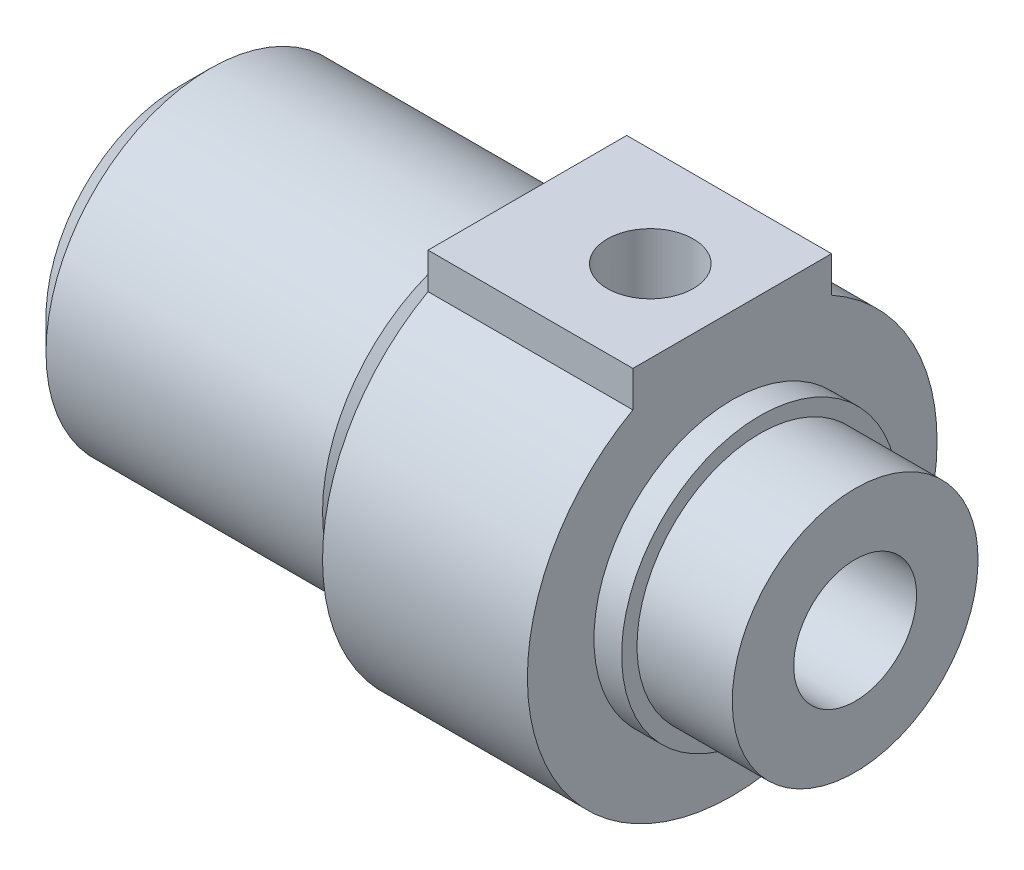
ISO-10303-21;
HEADER;
FILE_DESCRIPTION(('STEP AP214'),'2;1');
FILE_NAME('part.step','',(''),(''),'','','');
FILE_SCHEMA(('AUTOMOTIVE_DESIGN { 1 0 10303 214 1 1 1 1 }'));
ENDSEC;
DATA;
#1=APPLICATION_CONTEXT('core data for automotive mechanical design processes');
#2=APPLICATION_PROTOCOL_DEFINITION('international standard','automotive_design',2000,#1);
#3=PRODUCT_CONTEXT('',#1,'mechanical');
#4=PRODUCT('Part','Part','',(#3));
#5=PRODUCT_RELATED_PRODUCT_CATEGORY('part','',(#4));
#6=PRODUCT_DEFINITION_FORMATION('','',#4);
#7=PRODUCT_DEFINITION_CONTEXT('part definition',#1,'design');
#8=PRODUCT_DEFINITION('design','',#6,#7);
#9=PRODUCT_DEFINITION_SHAPE('','',#8);
#10=(LENGTH_UNIT() NAMED_UNIT(*) SI_UNIT(.MILLI.,.METRE.));
#11=(NAMED_UNIT(*) PLANE_ANGLE_UNIT() SI_UNIT($,.RADIAN.));
#12=(NAMED_UNIT(*) SI_UNIT($,.STERADIAN.) SOLID_ANGLE_UNIT());
#13=UNCERTAINTY_MEASURE_WITH_UNIT(LENGTH_MEASURE(1.E-05),#10,'distance_accuracy_value','');
#14=(GEOMETRIC_REPRESENTATION_CONTEXT(3) GLOBAL_UNCERTAINTY_ASSIGNED_CONTEXT((#13)) GLOBAL_UNIT_ASSIGNED_CONTEXT((#10,
#11,#12)) REPRESENTATION_CONTEXT('',''));
#15=CARTESIAN_POINT('',(0.,0.,0.));
#16=DIRECTION('',(0.,0.,1.));
#17=DIRECTION('',(1.,0.,0.));
#18=AXIS2_PLACEMENT_3D('',#15,#16,#17);
#19=CARTESIAN_POINT('',(33.,10.5,4.85));
#20=DIRECTION('',(0.,-1.,0.));
#21=DIRECTION('',(0.,0.,-1.));
#22=AXIS2_PLACEMENT_3D('',#19,#20,#21);
#23=PLANE('',#22);
#24=CARTESIAN_POINT('',(23.,10.5,0.));
#25=DIRECTION('',(0.,1.,0.));
#26=DIRECTION('',(0.,0.,1.));
#27=AXIS2_PLACEMENT_3D('',#24,#25,#26);
#28=CIRCLE('',#27,2.1);
#29=CARTESIAN_POINT('',(23.,10.5,2.1));
#30=VERTEX_POINT('',#29);
#31=EDGE_CURVE('E195',#30,#30,#28,.T.);
#32=ORIENTED_EDGE('',*,*,#31,.F.);
#33=EDGE_LOOP('',(#32));
#34=FACE_BOUND('',#33,.T.);
#35=DIRECTION('',(0.,0.,-1.));
#36=VECTOR('',#35,1.);
#37=CARTESIAN_POINT('',(17.,10.5,4.85));
#38=LINE('',#37,#36);
#39=CARTESIAN_POINT('',(17.,10.5,4.85));
#40=VERTEX_POINT('',#39);
#41=CARTESIAN_POINT('',(17.,10.5,-4.85));
#42=VERTEX_POINT('',#41);
#43=EDGE_CURVE('E57',#40,#42,#38,.T.);
#44=ORIENTED_EDGE('',*,*,#43,.F.);
#45=DIRECTION('',(-1.,0.,0.));
#46=VECTOR('',#45,1.);
#47=CARTESIAN_POINT('',(33.,10.5,4.85));
#48=LINE('',#47,#46);
#49=CARTESIAN_POINT('',(27.,10.5,4.85));
#50=VERTEX_POINT('',#49);
#51=EDGE_CURVE('E104',#50,#40,#48,.T.);
#52=ORIENTED_EDGE('',*,*,#51,.F.);
#53=DIRECTION('',(0.,0.,-1.));
#54=VECTOR('',#53,1.);
#55=CARTESIAN_POINT('',(27.,10.5,4.85));
#56=LINE('',#55,#54);
#57=CARTESIAN_POINT('',(27.,10.5,-4.85));
#58=VERTEX_POINT('',#57);
#59=EDGE_CURVE('E106',#50,#58,#56,.T.);
#60=ORIENTED_EDGE('',*,*,#59,.T.);
#61=DIRECTION('',(-1.,0.,0.));
#62=VECTOR('',#61,1.);
#63=CARTESIAN_POINT('',(33.,10.5,-4.85));
#64=LINE('',#63,#62);
#65=EDGE_CURVE('E102',#58,#42,#64,.T.);
#66=ORIENTED_EDGE('',*,*,#65,.T.);
#67=EDGE_LOOP('',(#44,#52,#60,#66));
#68=FACE_BOUND('',#67,.T.);
#69=ADVANCED_FACE('F36',(#34,#68),#23,.F.);
#70=CARTESIAN_POINT('',(33.,8.74514150828905,4.85));
#71=DIRECTION('',(0.,0.,-1.));
#72=DIRECTION('',(-1.,0.,0.));
#73=AXIS2_PLACEMENT_3D('',#70,#71,#72);
#74=PLANE('',#73);
#75=DIRECTION('',(0.,1.,0.));
#76=VECTOR('',#75,1.);
#77=CARTESIAN_POINT('',(17.,8.74514150828905,4.85));
#78=LINE('',#77,#76);
#79=CARTESIAN_POINT('',(17.,8.74514150828905,4.85));
#80=VERTEX_POINT('',#79);
#81=EDGE_CURVE('E98',#80,#40,#78,.T.);
#82=ORIENTED_EDGE('',*,*,#81,.F.);
#83=DIRECTION('',(-1.,0.,0.));
#84=VECTOR('',#83,1.);
#85=CARTESIAN_POINT('',(33.,8.74514150828905,4.85));
#86=LINE('',#85,#84);
#87=CARTESIAN_POINT('',(27.,8.74514150828905,4.85));
#88=VERTEX_POINT('',#87);
#89=EDGE_CURVE('E97',#88,#80,#86,.T.);
#90=ORIENTED_EDGE('',*,*,#89,.F.);
#91=DIRECTION('',(0.,1.,0.));
#92=VECTOR('',#91,1.);
#93=CARTESIAN_POINT('',(27.,8.74514150828905,4.85));
#94=LINE('',#93,#92);
#95=EDGE_CURVE('E224',#88,#50,#94,.T.);
#96=ORIENTED_EDGE('',*,*,#95,.T.);
#97=ORIENTED_EDGE('',*,*,#51,.T.);
#98=EDGE_LOOP('',(#82,#90,#96,#97));
#99=FACE_BOUND('',#98,.T.);
#100=ADVANCED_FACE('F132',(#99),#74,.F.);
#101=CARTESIAN_POINT('',(33.,0.,0.));
#102=DIRECTION('',(-1.,0.,0.));
#103=DIRECTION('',(0.,0.,1.));
#104=AXIS2_PLACEMENT_3D('',#101,#102,#103);
#105=CYLINDRICAL_SURFACE('',#104,10.);
#106=CARTESIAN_POINT('',(17.,0.,0.));
#107=DIRECTION('',(-1.,0.,0.));
#108=DIRECTION('',(0.,0.,1.));
#109=AXIS2_PLACEMENT_3D('',#106,#107,#108);
#110=CIRCLE('',#109,10.);
#111=CARTESIAN_POINT('',(17.,8.74514150828905,-4.85));
#112=VERTEX_POINT('',#111);
#113=EDGE_CURVE('E83',#112,#80,#110,.T.);
#114=ORIENTED_EDGE('',*,*,#113,.F.);
#115=DIRECTION('',(-1.,0.,0.));
#116=VECTOR('',#115,1.);
#117=CARTESIAN_POINT('',(33.,8.74514150828905,-4.85));
#118=LINE('',#117,#116);
#119=CARTESIAN_POINT('',(27.,8.74514150828905,-4.85));
#120=VERTEX_POINT('',#119);
#121=EDGE_CURVE('E95',#120,#112,#118,.T.);
#122=ORIENTED_EDGE('',*,*,#121,.F.);
#123=CARTESIAN_POINT('',(27.,0.,0.));
#124=DIRECTION('',(-1.,0.,0.));
#125=DIRECTION('',(0.,-1.,0.));
#126=AXIS2_PLACEMENT_3D('',#123,#124,#125);
#127=CIRCLE('',#126,10.);
#128=EDGE_CURVE('E65',#120,#88,#127,.T.);
#129=ORIENTED_EDGE('',*,*,#128,.T.);
#130=ORIENTED_EDGE('',*,*,#89,.T.);
#131=EDGE_LOOP('',(#114,#122,#129,#130));
#132=FACE_BOUND('',#131,.T.);
#133=ADVANCED_FACE('F94',(#132),#105,.T.);
#134=CARTESIAN_POINT('',(33.,8.74514150828905,-4.85));
#135=DIRECTION('',(0.,0.,1.));
#136=DIRECTION('',(1.,0.,0.));
#137=AXIS2_PLACEMENT_3D('',#134,#135,#136);
#138=PLANE('',#137);
#139=DIRECTION('',(0.,-1.,0.));
#140=VECTOR('',#139,1.);
#141=CARTESIAN_POINT('',(17.,8.74514150828905,-4.85));
#142=LINE('',#141,#140);
#143=EDGE_CURVE('E80',#42,#112,#142,.T.);
#144=ORIENTED_EDGE('',*,*,#143,.F.);
#145=ORIENTED_EDGE('',*,*,#65,.F.);
#146=DIRECTION('',(0.,-1.,0.));
#147=VECTOR('',#146,1.);
#148=CARTESIAN_POINT('',(27.,8.74514150828905,-4.85));
#149=LINE('',#148,#147);
#150=EDGE_CURVE('E89',#58,#120,#149,.T.);
#151=ORIENTED_EDGE('',*,*,#150,.T.);
#152=ORIENTED_EDGE('',*,*,#121,.T.);
#153=EDGE_LOOP('',(#144,#145,#151,#152));
#154=FACE_BOUND('',#153,.T.);
#155=ADVANCED_FACE('F101',(#154),#138,.F.);
#156=CARTESIAN_POINT('',(27.,14.,0.));
#157=DIRECTION('',(-1.,0.,0.));
#158=DIRECTION('',(0.,-1.,0.));
#159=AXIS2_PLACEMENT_3D('',#156,#157,#158);
#160=PLANE('',#159);
#161=CARTESIAN_POINT('',(27.,0.,0.));
#162=DIRECTION('',(1.,0.,0.));
#163=DIRECTION('',(0.,1.,0.));
#164=AXIS2_PLACEMENT_3D('',#161,#162,#163);
#165=CIRCLE('',#164,6.75);
#166=CARTESIAN_POINT('',(27.,6.75,0.));
#167=VERTEX_POINT('',#166);
#168=EDGE_CURVE('E220',#167,#167,#165,.T.);
#169=ORIENTED_EDGE('',*,*,#168,.F.);
#170=EDGE_LOOP('',(#169));
#171=FACE_BOUND('',#170,.T.);
#172=ORIENTED_EDGE('',*,*,#95,.F.);
#173=ORIENTED_EDGE('',*,*,#128,.F.);
#174=ORIENTED_EDGE('',*,*,#150,.F.);
#175=ORIENTED_EDGE('',*,*,#59,.F.);
#176=EDGE_LOOP('',(#172,#173,#174,#175));
#177=FACE_BOUND('',#176,.T.);
#178=ADVANCED_FACE('F145',(#171,#177),#160,.F.);
#179=CARTESIAN_POINT('',(45.5,0.,0.));
#180=DIRECTION('',(1.,0.,0.));
#181=DIRECTION('',(0.,1.,0.));
#182=AXIS2_PLACEMENT_3D('',#179,#180,#181);
#183=CYLINDRICAL_SURFACE('',#182,6.75);
#184=CARTESIAN_POINT('',(28.35,0.,0.));
#185=DIRECTION('',(1.,0.,0.));
#186=DIRECTION('',(0.,1.,0.));
#187=AXIS2_PLACEMENT_3D('',#184,#185,#186);
#188=CIRCLE('',#187,6.75);
#189=CARTESIAN_POINT('',(28.35,6.75,0.));
#190=VERTEX_POINT('',#189);
#191=EDGE_CURVE('E217',#190,#190,#188,.T.);
#192=ORIENTED_EDGE('',*,*,#191,.F.);
#193=EDGE_LOOP('',(#192));
#194=FACE_BOUND('',#193,.T.);
#195=ORIENTED_EDGE('',*,*,#168,.T.);
#196=EDGE_LOOP('',(#195));
#197=FACE_BOUND('',#196,.T.);
#198=ADVANCED_FACE('F154',(#194,#197),#183,.T.);
#199=CARTESIAN_POINT('',(28.35,6.75,0.));
#200=DIRECTION('',(-1.,0.,0.));
#201=DIRECTION('',(0.,-1.,0.));
#202=AXIS2_PLACEMENT_3D('',#199,#200,#201);
#203=PLANE('',#202);
#204=CARTESIAN_POINT('',(28.35,0.,0.));
#205=DIRECTION('',(1.,0.,0.));
#206=DIRECTION('',(0.,1.,0.));
#207=AXIS2_PLACEMENT_3D('',#204,#205,#206);
#208=CIRCLE('',#207,6.);
#209=CARTESIAN_POINT('',(28.35,6.,0.));
#210=VERTEX_POINT('',#209);
#211=EDGE_CURVE('E214',#210,#210,#208,.T.);
#212=ORIENTED_EDGE('',*,*,#211,.F.);
#213=EDGE_LOOP('',(#212));
#214=FACE_BOUND('',#213,.T.);
#215=ORIENTED_EDGE('',*,*,#191,.T.);
#216=EDGE_LOOP('',(#215));
#217=FACE_BOUND('',#216,.T.);
#218=ADVANCED_FACE('F158',(#214,#217),#203,.F.);
#219=CARTESIAN_POINT('',(45.5,0.,0.));
#220=DIRECTION('',(1.,0.,0.));
#221=DIRECTION('',(0.,1.,0.));
#222=AXIS2_PLACEMENT_3D('',#219,#220,#221);
#223=CYLINDRICAL_SURFACE('',#222,6.);
#224=CARTESIAN_POINT('',(33.,0.,0.));
#225=DIRECTION('',(1.,0.,0.));
#226=DIRECTION('',(0.,1.,0.));
#227=AXIS2_PLACEMENT_3D('',#224,#225,#226);
#228=CIRCLE('',#227,6.);
#229=CARTESIAN_POINT('',(33.,6.,0.));
#230=VERTEX_POINT('',#229);
#231=EDGE_CURVE('E211',#230,#230,#228,.T.);
#232=ORIENTED_EDGE('',*,*,#231,.F.);
#233=EDGE_LOOP('',(#232));
#234=FACE_BOUND('',#233,.T.);
#235=ORIENTED_EDGE('',*,*,#211,.T.);
#236=EDGE_LOOP('',(#235));
#237=FACE_BOUND('',#236,.T.);
#238=ADVANCED_FACE('F150',(#234,#237),#223,.T.);
#239=CARTESIAN_POINT('',(33.,0.,0.));
#240=DIRECTION('',(1.,0.,0.));
#241=DIRECTION('',(0.,0.,-1.));
#242=AXIS2_PLACEMENT_3D('',#239,#240,#241);
#243=PLANE('',#242);
#244=CARTESIAN_POINT('',(33.,0.,0.));
#245=DIRECTION('',(1.,0.,0.));
#246=DIRECTION('',(0.,0.,-1.));
#247=AXIS2_PLACEMENT_3D('',#244,#245,#246);
#248=CIRCLE('',#247,3.);
#249=CARTESIAN_POINT('',(33.,0.,-3.));
#250=VERTEX_POINT('',#249);
#251=EDGE_CURVE('E188',#250,#250,#248,.T.);
#252=ORIENTED_EDGE('',*,*,#251,.F.);
#253=EDGE_LOOP('',(#252));
#254=FACE_BOUND('',#253,.T.);
#255=ORIENTED_EDGE('',*,*,#231,.T.);
#256=EDGE_LOOP('',(#255));
#257=FACE_BOUND('',#256,.T.);
#258=ADVANCED_FACE('F147',(#254,#257),#243,.T.);
#259=CARTESIAN_POINT('',(17.,7.5,0.));
#260=DIRECTION('',(-1.,0.,0.));
#261=DIRECTION('',(0.,0.,1.));
#262=AXIS2_PLACEMENT_3D('',#259,#260,#261);
#263=PLANE('',#262);
#264=CARTESIAN_POINT('',(17.,0.,0.));
#265=DIRECTION('',(-1.,0.,0.));
#266=DIRECTION('',(0.,0.,1.));
#267=AXIS2_PLACEMENT_3D('',#264,#265,#266);
#268=CIRCLE('',#267,7.5);
#269=CARTESIAN_POINT('',(17.,0.,7.5));
#270=VERTEX_POINT('',#269);
#271=EDGE_CURVE('E99',#270,#270,#268,.T.);
#272=ORIENTED_EDGE('',*,*,#271,.F.);
#273=EDGE_LOOP('',(#272));
#274=FACE_BOUND('',#273,.T.);
#275=ORIENTED_EDGE('',*,*,#43,.T.);
#276=ORIENTED_EDGE('',*,*,#143,.T.);
#277=ORIENTED_EDGE('',*,*,#113,.T.);
#278=ORIENTED_EDGE('',*,*,#81,.T.);
#279=EDGE_LOOP('',(#275,#276,#277,#278));
#280=FACE_BOUND('',#279,.T.);
#281=ADVANCED_FACE('F82',(#274,#280),#263,.T.);
#282=CARTESIAN_POINT('',(0.,0.,0.));
#283=DIRECTION('',(-1.,0.,0.));
#284=DIRECTION('',(0.,0.,1.));
#285=AXIS2_PLACEMENT_3D('',#282,#283,#284);
#286=CYLINDRICAL_SURFACE('',#285,7.5);
#287=ORIENTED_EDGE('',*,*,#271,.T.);
#288=EDGE_LOOP('',(#287));
#289=FACE_BOUND('',#288,.T.);
#290=CARTESIAN_POINT('',(15.5,0.,0.));
#291=DIRECTION('',(-1.,0.,0.));
#292=DIRECTION('',(0.,0.,1.));
#293=AXIS2_PLACEMENT_3D('',#290,#291,#292);
#294=CIRCLE('',#293,7.5);
#295=CARTESIAN_POINT('',(15.5,0.,7.5));
#296=VERTEX_POINT('',#295);
#297=EDGE_CURVE('E204',#296,#296,#294,.T.);
#298=ORIENTED_EDGE('',*,*,#297,.F.);
#299=EDGE_LOOP('',(#298));
#300=FACE_BOUND('',#299,.T.);
#301=ADVANCED_FACE('F168',(#289,#300),#286,.T.);
#302=CARTESIAN_POINT('',(15.,0.,0.));
#303=DIRECTION('',(-1.,0.,0.));
#304=DIRECTION('',(0.,0.,1.));
#305=AXIS2_PLACEMENT_3D('',#302,#303,#304);
#306=CONICAL_SURFACE('',#305,8.,0.78539816339745);
#307=ORIENTED_EDGE('',*,*,#297,.T.);
#308=EDGE_LOOP('',(#307));
#309=FACE_BOUND('',#308,.T.);
#310=CARTESIAN_POINT('',(15.,0.,0.));
#311=DIRECTION('',(-1.,0.,0.));
#312=DIRECTION('',(0.,0.,1.));
#313=AXIS2_PLACEMENT_3D('',#310,#311,#312);
#314=CIRCLE('',#313,8.);
#315=CARTESIAN_POINT('',(15.,0.,8.));
#316=VERTEX_POINT('',#315);
#317=EDGE_CURVE('E197',#316,#316,#314,.T.);
#318=ORIENTED_EDGE('',*,*,#317,.F.);
#319=EDGE_LOOP('',(#318));
#320=FACE_BOUND('',#319,.T.);
#321=ADVANCED_FACE('F172',(#309,#320),#306,.T.);
#322=CARTESIAN_POINT('',(0.,0.,0.));
#323=DIRECTION('',(-1.,0.,0.));
#324=DIRECTION('',(0.,0.,1.));
#325=AXIS2_PLACEMENT_3D('',#322,#323,#324);
#326=CYLINDRICAL_SURFACE('',#325,8.);
#327=CARTESIAN_POINT('',(1.50000000000001,0.,0.));
#328=DIRECTION('',(1.,0.,0.));
#329=DIRECTION('',(0.,0.,-1.));
#330=AXIS2_PLACEMENT_3D('',#327,#328,#329);
#331=CIRCLE('',#330,8.);
#332=CARTESIAN_POINT('',(1.50000000000001,0.,-8.));
#333=VERTEX_POINT('',#332);
#334=EDGE_CURVE('E11',#333,#333,#331,.T.);
#335=ORIENTED_EDGE('',*,*,#334,.T.);
#336=EDGE_LOOP('',(#335));
#337=FACE_BOUND('',#336,.T.);
#338=ORIENTED_EDGE('',*,*,#317,.T.);
#339=EDGE_LOOP('',(#338));
#340=FACE_BOUND('',#339,.T.);
#341=ADVANCED_FACE('F127',(#337,#340),#326,.T.);
#342=CARTESIAN_POINT('',(0.,0.,0.));
#343=DIRECTION('',(1.,0.,0.));
#344=DIRECTION('',(0.,0.,-1.));
#345=AXIS2_PLACEMENT_3D('',#342,#343,#344);
#346=PLANE('',#345);
#347=CARTESIAN_POINT('',(0.,0.,0.));
#348=DIRECTION('',(1.,0.,0.));
#349=DIRECTION('',(0.,0.,-1.));
#350=AXIS2_PLACEMENT_3D('',#347,#348,#349);
#351=CIRCLE('',#350,3.);
#352=CARTESIAN_POINT('',(0.,0.,-3.));
#353=VERTEX_POINT('',#352);
#354=EDGE_CURVE('E192',#353,#353,#351,.T.);
#355=ORIENTED_EDGE('',*,*,#354,.T.);
#356=EDGE_LOOP('',(#355));
#357=FACE_BOUND('',#356,.T.);
#358=CARTESIAN_POINT('',(0.,0.,0.));
#359=DIRECTION('',(1.,0.,0.));
#360=DIRECTION('',(0.,0.,-1.));
#361=AXIS2_PLACEMENT_3D('',#358,#359,#360);
#362=CIRCLE('',#361,6.49999999999999);
#363=CARTESIAN_POINT('',(0.,0.,-6.49999999999999));
#364=VERTEX_POINT('',#363);
#365=EDGE_CURVE('E50',#364,#364,#362,.F.);
#366=ORIENTED_EDGE('',*,*,#365,.T.);
#367=EDGE_LOOP('',(#366));
#368=FACE_BOUND('',#367,.T.);
#369=ADVANCED_FACE('F116',(#357,#368),#346,.F.);
#370=CARTESIAN_POINT('',(0.,0.,0.));
#371=DIRECTION('',(1.,0.,0.));
#372=DIRECTION('',(0.,0.,-1.));
#373=AXIS2_PLACEMENT_3D('',#370,#371,#372);
#374=CONICAL_SURFACE('',#373,6.49999999999999,0.785398163397448);
#375=ORIENTED_EDGE('',*,*,#334,.F.);
#376=EDGE_LOOP('',(#375));
#377=FACE_BOUND('',#376,.T.);
#378=ORIENTED_EDGE('',*,*,#365,.F.);
#379=EDGE_LOOP('',(#378));
#380=FACE_BOUND('',#379,.T.);
#381=ADVANCED_FACE('F38',(#377,#380),#374,.T.);
#382=CARTESIAN_POINT('',(23.,10.5,0.));
#383=DIRECTION('',(0.,1.,0.));
#384=DIRECTION('',(0.,0.,1.));
#385=AXIS2_PLACEMENT_3D('',#382,#383,#384);
#386=CYLINDRICAL_SURFACE('',#385,2.1);
#387=CARTESIAN_POINT('',(23.,2.14242852856286,2.1));
#388=CARTESIAN_POINT('',(22.8991988179027,2.14243638279411,2.09999602164293));
#389=CARTESIAN_POINT('',(22.7983754728224,2.14968361222002,2.09267425451303));
#390=CARTESIAN_POINT('',(22.6004673952412,2.17713849427744,2.06408052690835));
#391=CARTESIAN_POINT('',(22.5033914844298,2.19737496074822,2.04277754974696));
#392=CARTESIAN_POINT('',(22.3165820766888,2.24699925671913,1.98804598401033));
#393=CARTESIAN_POINT('',(22.2267794921517,2.27628384865,1.95475351750639));
#394=CARTESIAN_POINT('',(22.0542401894225,2.34052168482311,1.87736165117184));
#395=CARTESIAN_POINT('',(21.971503963861,2.37547532379077,1.83326149871241));
#396=CARTESIAN_POINT('',(21.7995826235148,2.45442122730989,1.72654345994895));
#397=CARTESIAN_POINT('',(21.71180552072,2.49892440249037,1.66203515877101));
#398=CARTESIAN_POINT('',(21.5470635982075,2.587704985701,1.52013414958954));
#399=CARTESIAN_POINT('',(21.4701123074175,2.63198204575611,1.4427255794177));
#400=CARTESIAN_POINT('',(21.316441193349,2.72396309113983,1.26173250355452));
#401=CARTESIAN_POINT('',(21.2418942211988,2.7710097406898,1.15593562828217));
#402=CARTESIAN_POINT('',(21.1123767833799,2.85494261250272,0.929408573839368));
#403=CARTESIAN_POINT('',(21.0573671660404,2.89184912098326,0.80870892096122));
#404=CARTESIAN_POINT('',(20.9822063496233,2.94295124645066,0.589969945445681));
#405=CARTESIAN_POINT('',(20.9566581203425,2.96058586289675,0.494574305038635));
#406=CARTESIAN_POINT('',(20.9191737707145,2.98657838567664,0.299930223787058));
#407=CARTESIAN_POINT('',(20.9072267817453,2.99494369887954,0.200684924844656));
#408=CARTESIAN_POINT('',(20.8976169057927,3.00166671758024,0.000967143719220179));
#409=CARTESIAN_POINT('',(20.8999817606914,3.00000498681155,-0.0995073448428438));
#410=CARTESIAN_POINT('',(20.9189143274313,2.98678296023488,-0.298450041145121));
#411=CARTESIAN_POINT('',(20.9354859998781,2.97521990411617,-0.3969176815744));
#412=CARTESIAN_POINT('',(20.98136721481,2.9435711394848,-0.586910014758707));
#413=CARTESIAN_POINT('',(21.0103774656245,2.92368592848238,-0.678541865368288));
#414=CARTESIAN_POINT('',(21.0797757807128,2.876909009763,-0.855439349247825));
#415=CARTESIAN_POINT('',(21.1201660801607,2.85001592569624,-0.940703727706019));
#416=CARTESIAN_POINT('',(21.2160821260957,2.78763084510121,-1.11283793862578));
#417=CARTESIAN_POINT('',(21.2727978384847,2.75151250378176,-1.19881384252342));
#418=CARTESIAN_POINT('',(21.3970977260072,2.67523565239691,-1.3605619568758));
#419=CARTESIAN_POINT('',(21.4646936065031,2.63507280869808,-1.43632301459623));
#420=CARTESIAN_POINT('',(21.6225579565979,2.54604490567428,-1.58960261822576));
#421=CARTESIAN_POINT('',(21.7147195940943,2.4969066890714,-1.6650186720166));
#422=CARTESIAN_POINT('',(21.9115094955512,2.40154085459289,-1.79983510095356));
#423=CARTESIAN_POINT('',(22.0161345280853,2.3553124870012,-1.85923961448999));
#424=CARTESIAN_POINT('',(22.2114331109597,2.28159802338742,-1.94855264825869));
#425=CARTESIAN_POINT('',(22.2997254854026,2.25225087153781,-1.98210609109212));
#426=CARTESIAN_POINT('',(22.4822563241486,2.20236114038834,-2.03740031989552));
#427=CARTESIAN_POINT('',(22.5764832964627,2.18180211044458,-2.05916319745108));
#428=CARTESIAN_POINT('',(22.7699480304865,2.15261274855801,-2.08967380066584));
#429=CARTESIAN_POINT('',(22.8692268766363,2.14410534183546,-2.09828747378879));
#430=CARTESIAN_POINT('',(23.0681948287142,2.1412086525496,-2.10124630568856));
#431=CARTESIAN_POINT('',(23.1678837718425,2.14681422301691,-2.09559666625962));
#432=CARTESIAN_POINT('',(23.3501488282714,2.16922512584482,-2.07235487849599));
#433=CARTESIAN_POINT('',(23.4331776779779,2.18436555835548,-2.05653171310714));
#434=CARTESIAN_POINT('',(23.5951542045942,2.22215988293772,-2.01563399534999));
#435=CARTESIAN_POINT('',(23.6740974784041,2.2448216937327,-1.99054968944477));
#436=CARTESIAN_POINT('',(23.8630755821599,2.30728989885127,-1.91823476055615));
#437=CARTESIAN_POINT('',(23.9702383529714,2.35014375000236,-1.86613806390327));
#438=CARTESIAN_POINT('',(24.172912609648,2.44079519453309,-1.74591178220927));
#439=CARTESIAN_POINT('',(24.2684007614138,2.48860234700188,-1.67775086020861));
#440=CARTESIAN_POINT('',(24.4485250649496,2.58502403499954,-1.52511012344375));
#441=CARTESIAN_POINT('',(24.5329224098657,2.63363678085936,-1.44034661461234));
#442=CARTESIAN_POINT('',(24.6870337817786,2.72622495781879,-1.25629615404689));
#443=CARTESIAN_POINT('',(24.7567693386589,2.77020714050646,-1.15703086572033));
#444=CARTESIAN_POINT('',(24.8693222840851,2.84303432184209,-0.962367573398692));
#445=CARTESIAN_POINT('',(24.9146662316987,2.87317642109174,-0.868922194503136));
#446=CARTESIAN_POINT('',(24.9915502738121,2.92497219655113,-0.674279878008685));
#447=CARTESIAN_POINT('',(25.0230987416519,2.94663102095635,-0.573087686390255));
#448=CARTESIAN_POINT('',(25.0708367277367,2.97960788705012,-0.364831618377042));
#449=CARTESIAN_POINT('',(25.0869375148844,2.99086617475908,-0.257737513076736));
#450=CARTESIAN_POINT('',(25.1023699780085,3.00165393558886,-0.0417666466583805));
#451=CARTESIAN_POINT('',(25.1017081950419,3.0011879837197,0.0671094025392368));
#452=CARTESIAN_POINT('',(25.0845686089178,2.98921365831379,0.272289777850558));
#453=CARTESIAN_POINT('',(25.0696252775566,2.97877665808159,0.368792300103629));
#454=CARTESIAN_POINT('',(25.0269486580559,2.94928525203853,0.557534851493457));
#455=CARTESIAN_POINT('',(24.999212936831,2.93022920691689,0.64977406608462));
#456=CARTESIAN_POINT('',(24.9310361193616,2.88413721441091,0.831156056304381));
#457=CARTESIAN_POINT('',(24.8901841878995,2.85684523794218,0.920077354039737));
#458=CARTESIAN_POINT('',(24.7976386470762,2.79647566783174,1.08988850197529));
#459=CARTESIAN_POINT('',(24.7459429405351,2.76339695524428,1.17077679413152));
#460=CARTESIAN_POINT('',(24.6241705529461,2.68798939205913,1.33572629525633));
#461=CARTESIAN_POINT('',(24.5524836584681,2.64502293494774,1.41830558709393));
#462=CARTESIAN_POINT('',(24.3976783008358,2.55723192062595,1.57109978754637));
#463=CARTESIAN_POINT('',(24.3145360668307,2.51240363872625,1.64128827461709));
#464=CARTESIAN_POINT('',(24.1238335933986,2.4176556414013,1.77845654272628));
#465=CARTESIAN_POINT('',(24.0144895909964,2.36804412270408,1.84319523687473));
#466=CARTESIAN_POINT('',(23.7827353928988,2.27846176062126,1.9528530982932));
#467=CARTESIAN_POINT('',(23.660366231995,2.23846186201534,1.99783234726931));
#468=CARTESIAN_POINT('',(23.4472816295211,2.18705372583927,2.05371335315947));
#469=CARTESIAN_POINT('',(23.3594738103755,2.17056502262193,2.07096487029759));
#470=CARTESIAN_POINT('',(23.1811132360681,2.14825822428073,2.09410004221785));
#471=CARTESIAN_POINT('',(23.0905655632978,2.14242147187103,2.10000357438416));
#472=CARTESIAN_POINT('',(23.,2.14242852856286,2.1));
#473=B_SPLINE_CURVE_WITH_KNOTS('',3,(#387,#388,#389,#390,#391,#392,#393,#394,#395,#396,#397,
#398,#399,#400,#401,#402,#403,#404,#405,#406,#407,#408,#409,#410,#411,#412,#413,#414,#415,#416,
#417,#418,#419,#420,#421,#422,#423,#424,#425,#426,#427,#428,#429,#430,#431,#432,#433,#434,#435,
#436,#437,#438,#439,#440,#441,#442,#443,#444,#445,#446,#447,#448,#449,#450,#451,#452,#453,#454,
#455,#456,#457,#458,#459,#460,#461,#462,#463,#464,#465,#466,#467,#468,#469,#470,#471,#472),
.UNSPECIFIED.,.T.,.F.,(4,2,2,2,2,2,2,2,2,2,2,2,2,2,2,2,2,2,2,2,2,2,2,2,2,2,2,2,2,2,2,2,2,2,2,2,
2,2,2,2,2,2,4),(0.,0.301973223435531,0.604618635711376,0.903931039140896,1.20326429210161,
1.55501769378841,1.90720684651705,2.31804977810943,2.72806469734051,3.02773360434289,
3.32716288032116,3.62717275157128,3.92726628739669,4.22051205037772,4.51381545043928,
4.84003888345372,5.16661565707935,5.55151589746292,5.93631655978082,6.23199289437158,
6.52711329718779,6.82522273911176,7.12322347697785,7.37980613638281,7.6366597948759,
8.01451127327346,8.39310602933115,8.77884561454899,9.16401474783144,9.48714146722315,
9.81007178763062,10.134846099452,10.4594936804375,10.7527707598948,11.0461036430495,
11.3497065387119,11.6533682052277,12.0045164637744,12.3564046795999,12.7636402272857,
13.1696287925794,13.4414153585328,13.7127254216916),.UNSPECIFIED.);
#474=CARTESIAN_POINT('',(23.,2.14242852856286,2.1));
#475=VERTEX_POINT('',#474);
#476=EDGE_CURVE('E40',#475,#475,#473,.T.);
#477=ORIENTED_EDGE('',*,*,#476,.T.);
#478=EDGE_LOOP('',(#477));
#479=FACE_BOUND('',#478,.T.);
#480=ORIENTED_EDGE('',*,*,#31,.T.);
#481=EDGE_LOOP('',(#480));
#482=FACE_BOUND('',#481,.T.);
#483=ADVANCED_FACE('F119',(#479,#482),#386,.F.);
#484=CARTESIAN_POINT('',(0.,0.,0.));
#485=DIRECTION('',(1.,0.,0.));
#486=DIRECTION('',(0.,0.,-1.));
#487=AXIS2_PLACEMENT_3D('',#484,#485,#486);
#488=CYLINDRICAL_SURFACE('',#487,3.);
#489=ORIENTED_EDGE('',*,*,#251,.T.);
#490=EDGE_LOOP('',(#489));
#491=FACE_BOUND('',#490,.T.);
#492=ORIENTED_EDGE('',*,*,#354,.F.);
#493=EDGE_LOOP('',(#492));
#494=FACE_BOUND('',#493,.T.);
#495=ORIENTED_EDGE('',*,*,#476,.F.);
#496=EDGE_LOOP('',(#495));
#497=FACE_BOUND('',#496,.T.);
#498=ADVANCED_FACE('F125',(#491,#494,#497),#488,.F.);
#499=CLOSED_SHELL('',(#69,#100,#133,#155,#178,#198,#218,#238,#258,#281,#301,#321,#341,#369,#381,
#483,#498));
#500=MANIFOLD_SOLID_BREP('B2',#499);
#501=ADVANCED_BREP_SHAPE_REPRESENTATION('',(#18,#500),#14);
#502=SHAPE_DEFINITION_REPRESENTATION(#9,#501);
ENDSEC;
END-ISO-10303-21;
